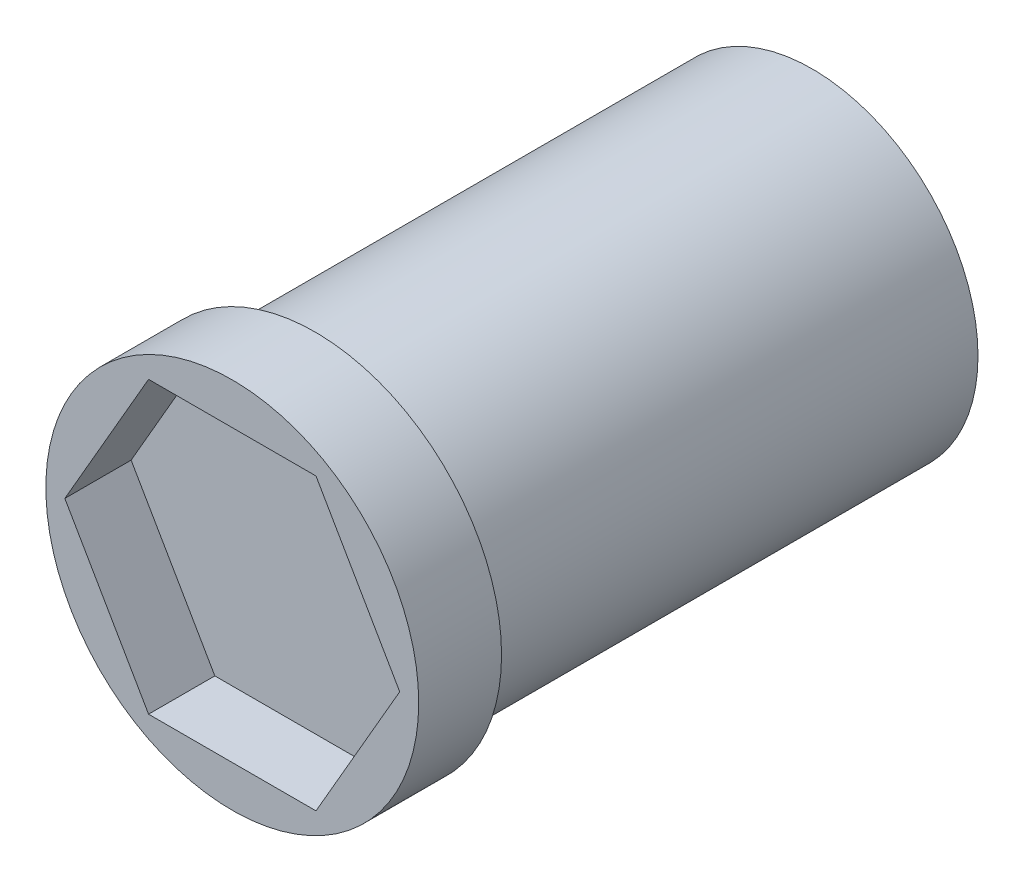
ISO-10303-21;
HEADER;
FILE_DESCRIPTION(('STEP AP214'),'2;1');
FILE_NAME('part.step','',(''),(''),'','','');
FILE_SCHEMA(('AUTOMOTIVE_DESIGN { 1 0 10303 214 1 1 1 1 }'));
ENDSEC;
DATA;
#1=APPLICATION_CONTEXT('core data for automotive mechanical design processes');
#2=APPLICATION_PROTOCOL_DEFINITION('international standard','automotive_design',2000,#1);
#3=PRODUCT_CONTEXT('',#1,'mechanical');
#4=PRODUCT('Part','Part','',(#3));
#5=PRODUCT_RELATED_PRODUCT_CATEGORY('part','',(#4));
#6=PRODUCT_DEFINITION_FORMATION('','',#4);
#7=PRODUCT_DEFINITION_CONTEXT('part definition',#1,'design');
#8=PRODUCT_DEFINITION('design','',#6,#7);
#9=PRODUCT_DEFINITION_SHAPE('','',#8);
#10=(LENGTH_UNIT() NAMED_UNIT(*) SI_UNIT(.MILLI.,.METRE.));
#11=(NAMED_UNIT(*) PLANE_ANGLE_UNIT() SI_UNIT($,.RADIAN.));
#12=(NAMED_UNIT(*) SI_UNIT($,.STERADIAN.) SOLID_ANGLE_UNIT());
#13=UNCERTAINTY_MEASURE_WITH_UNIT(LENGTH_MEASURE(1.E-05),#10,'distance_accuracy_value','');
#14=(GEOMETRIC_REPRESENTATION_CONTEXT(3) GLOBAL_UNCERTAINTY_ASSIGNED_CONTEXT((#13)) GLOBAL_UNIT_ASSIGNED_CONTEXT((#10,
#11,#12)) REPRESENTATION_CONTEXT('',''));
#15=CARTESIAN_POINT('',(0.,0.,0.));
#16=DIRECTION('',(0.,0.,1.));
#17=DIRECTION('',(1.,0.,0.));
#18=AXIS2_PLACEMENT_3D('',#15,#16,#17);
#19=CARTESIAN_POINT('',(0.,0.,60.));
#20=DIRECTION('',(0.,0.,-1.));
#21=DIRECTION('',(-1.,0.,0.));
#22=AXIS2_PLACEMENT_3D('',#19,#20,#21);
#23=CYLINDRICAL_SURFACE('',#22,20.);
#24=CARTESIAN_POINT('',(0.,0.,60.));
#25=DIRECTION('',(0.,0.,1.));
#26=DIRECTION('',(1.,0.,0.));
#27=AXIS2_PLACEMENT_3D('',#24,#25,#26);
#28=CIRCLE('',#27,20.);
#29=CARTESIAN_POINT('',(20.,0.,60.));
#30=VERTEX_POINT('',#29);
#31=EDGE_CURVE('E11',#30,#30,#28,.T.);
#32=ORIENTED_EDGE('',*,*,#31,.F.);
#33=EDGE_LOOP('',(#32));
#34=FACE_BOUND('',#33,.T.);
#35=CARTESIAN_POINT('',(0.,0.,0.));
#36=DIRECTION('',(0.,0.,1.));
#37=DIRECTION('',(1.,0.,0.));
#38=AXIS2_PLACEMENT_3D('',#35,#36,#37);
#39=CIRCLE('',#38,20.);
#40=CARTESIAN_POINT('',(20.,0.,0.));
#41=VERTEX_POINT('',#40);
#42=EDGE_CURVE('E46',#41,#41,#39,.T.);
#43=ORIENTED_EDGE('',*,*,#42,.T.);
#44=EDGE_LOOP('',(#43));
#45=FACE_BOUND('',#44,.T.);
#46=ADVANCED_FACE('F43',(#34,#45),#23,.T.);
#47=CARTESIAN_POINT('',(0.,0.,0.));
#48=DIRECTION('',(0.,0.,1.));
#49=DIRECTION('',(1.,0.,0.));
#50=AXIS2_PLACEMENT_3D('',#47,#48,#49);
#51=PLANE('',#50);
#52=ORIENTED_EDGE('',*,*,#42,.F.);
#53=EDGE_LOOP('',(#52));
#54=FACE_BOUND('',#53,.T.);
#55=ADVANCED_FACE('F193',(#54),#51,.F.);
#56=CARTESIAN_POINT('',(0.,0.,70.));
#57=DIRECTION('',(0.,0.,-1.));
#58=DIRECTION('',(-1.,0.,0.));
#59=AXIS2_PLACEMENT_3D('',#56,#57,#58);
#60=CYLINDRICAL_SURFACE('',#59,22.5);
#61=CARTESIAN_POINT('',(0.,0.,70.));
#62=DIRECTION('',(0.,0.,1.));
#63=DIRECTION('',(1.,0.,0.));
#64=AXIS2_PLACEMENT_3D('',#61,#62,#63);
#65=CIRCLE('',#64,22.5);
#66=CARTESIAN_POINT('',(22.5,0.,70.));
#67=VERTEX_POINT('',#66);
#68=EDGE_CURVE('E167',#67,#67,#65,.T.);
#69=ORIENTED_EDGE('',*,*,#68,.F.);
#70=EDGE_LOOP('',(#69));
#71=FACE_BOUND('',#70,.T.);
#72=CARTESIAN_POINT('',(0.,0.,60.));
#73=DIRECTION('',(0.,0.,1.));
#74=DIRECTION('',(1.,0.,0.));
#75=AXIS2_PLACEMENT_3D('',#72,#73,#74);
#76=CIRCLE('',#75,22.5);
#77=CARTESIAN_POINT('',(22.5,0.,60.));
#78=VERTEX_POINT('',#77);
#79=EDGE_CURVE('E157',#78,#78,#76,.T.);
#80=ORIENTED_EDGE('',*,*,#79,.T.);
#81=EDGE_LOOP('',(#80));
#82=FACE_BOUND('',#81,.T.);
#83=ADVANCED_FACE('F175',(#71,#82),#60,.T.);
#84=CARTESIAN_POINT('',(0.,0.,70.));
#85=DIRECTION('',(0.,0.,1.));
#86=DIRECTION('',(1.,0.,0.));
#87=AXIS2_PLACEMENT_3D('',#84,#85,#86);
#88=PLANE('',#87);
#89=DIRECTION('',(-0.5,-0.866025403784439,0.));
#90=VECTOR('',#89,1.);
#91=CARTESIAN_POINT('',(-10.1036297108185,17.5,70.));
#92=LINE('',#91,#90);
#93=CARTESIAN_POINT('',(-10.1036297108185,17.5,70.));
#94=VERTEX_POINT('',#93);
#95=CARTESIAN_POINT('',(-20.2072594216369,0.,70.));
#96=VERTEX_POINT('',#95);
#97=EDGE_CURVE('E58',#94,#96,#92,.T.);
#98=ORIENTED_EDGE('',*,*,#97,.F.);
#99=DIRECTION('',(-1.,0.,0.));
#100=VECTOR('',#99,1.);
#101=CARTESIAN_POINT('',(10.1036297108184,17.5,70.));
#102=LINE('',#101,#100);
#103=CARTESIAN_POINT('',(10.1036297108184,17.5,70.));
#104=VERTEX_POINT('',#103);
#105=EDGE_CURVE('E151',#104,#94,#102,.T.);
#106=ORIENTED_EDGE('',*,*,#105,.F.);
#107=DIRECTION('',(-0.5,0.866025403784439,0.));
#108=VECTOR('',#107,1.);
#109=CARTESIAN_POINT('',(20.2072594216369,0.,70.));
#110=LINE('',#109,#108);
#111=CARTESIAN_POINT('',(20.2072594216369,0.,70.));
#112=VERTEX_POINT('',#111);
#113=EDGE_CURVE('E148',#112,#104,#110,.T.);
#114=ORIENTED_EDGE('',*,*,#113,.F.);
#115=DIRECTION('',(0.5,0.866025403784439,0.));
#116=VECTOR('',#115,1.);
#117=CARTESIAN_POINT('',(10.1036297108185,-17.5,70.));
#118=LINE('',#117,#116);
#119=CARTESIAN_POINT('',(10.1036297108185,-17.5,70.));
#120=VERTEX_POINT('',#119);
#121=EDGE_CURVE('E106',#120,#112,#118,.T.);
#122=ORIENTED_EDGE('',*,*,#121,.F.);
#123=DIRECTION('',(1.,0.,0.));
#124=VECTOR('',#123,1.);
#125=CARTESIAN_POINT('',(-10.1036297108184,-17.5,70.));
#126=LINE('',#125,#124);
#127=CARTESIAN_POINT('',(-10.1036297108184,-17.5,70.));
#128=VERTEX_POINT('',#127);
#129=EDGE_CURVE('E142',#128,#120,#126,.T.);
#130=ORIENTED_EDGE('',*,*,#129,.F.);
#131=DIRECTION('',(0.5,-0.866025403784439,0.));
#132=VECTOR('',#131,1.);
#133=CARTESIAN_POINT('',(-20.2072594216369,0.,70.));
#134=LINE('',#133,#132);
#135=EDGE_CURVE('E138',#96,#128,#134,.T.);
#136=ORIENTED_EDGE('',*,*,#135,.F.);
#137=EDGE_LOOP('',(#98,#106,#114,#122,#130,#136));
#138=FACE_BOUND('',#137,.T.);
#139=ORIENTED_EDGE('',*,*,#68,.T.);
#140=EDGE_LOOP('',(#139));
#141=FACE_BOUND('',#140,.T.);
#142=ADVANCED_FACE('F180',(#138,#141),#88,.T.);
#143=CARTESIAN_POINT('',(0.,0.,60.));
#144=DIRECTION('',(0.,0.,1.));
#145=DIRECTION('',(1.,0.,0.));
#146=AXIS2_PLACEMENT_3D('',#143,#144,#145);
#147=PLANE('',#146);
#148=ORIENTED_EDGE('',*,*,#31,.T.);
#149=EDGE_LOOP('',(#148));
#150=FACE_BOUND('',#149,.T.);
#151=ORIENTED_EDGE('',*,*,#79,.F.);
#152=EDGE_LOOP('',(#151));
#153=FACE_BOUND('',#152,.T.);
#154=ADVANCED_FACE('F177',(#150,#153),#147,.F.);
#155=CARTESIAN_POINT('',(-10.1036297108185,17.5,62.));
#156=DIRECTION('',(-0.866025403784439,0.5,0.));
#157=DIRECTION('',(-0.5,-0.866025403784439,0.));
#158=AXIS2_PLACEMENT_3D('',#155,#156,#157);
#159=PLANE('',#158);
#160=ORIENTED_EDGE('',*,*,#97,.T.);
#161=DIRECTION('',(0.,0.,1.));
#162=VECTOR('',#161,1.);
#163=CARTESIAN_POINT('',(-20.2072594216369,0.,62.));
#164=LINE('',#163,#162);
#165=CARTESIAN_POINT('',(-20.2072594216369,0.,62.));
#166=VERTEX_POINT('',#165);
#167=EDGE_CURVE('E88',#166,#96,#164,.T.);
#168=ORIENTED_EDGE('',*,*,#167,.F.);
#169=DIRECTION('',(-0.5,-0.866025403784439,0.));
#170=VECTOR('',#169,1.);
#171=CARTESIAN_POINT('',(-10.1036297108185,17.5,62.));
#172=LINE('',#171,#170);
#173=CARTESIAN_POINT('',(-10.1036297108185,17.5,62.));
#174=VERTEX_POINT('',#173);
#175=EDGE_CURVE('E154',#174,#166,#172,.T.);
#176=ORIENTED_EDGE('',*,*,#175,.F.);
#177=DIRECTION('',(0.,0.,1.));
#178=VECTOR('',#177,1.);
#179=CARTESIAN_POINT('',(-10.1036297108185,17.5,62.));
#180=LINE('',#179,#178);
#181=EDGE_CURVE('E66',#174,#94,#180,.T.);
#182=ORIENTED_EDGE('',*,*,#181,.T.);
#183=EDGE_LOOP('',(#160,#168,#176,#182));
#184=FACE_BOUND('',#183,.T.);
#185=ADVANCED_FACE('F179',(#184),#159,.F.);
#186=CARTESIAN_POINT('',(10.1036297108184,17.5,62.));
#187=DIRECTION('',(0.,1.,0.));
#188=DIRECTION('',(-1.,0.,0.));
#189=AXIS2_PLACEMENT_3D('',#186,#187,#188);
#190=PLANE('',#189);
#191=ORIENTED_EDGE('',*,*,#105,.T.);
#192=ORIENTED_EDGE('',*,*,#181,.F.);
#193=DIRECTION('',(-1.,0.,0.));
#194=VECTOR('',#193,1.);
#195=CARTESIAN_POINT('',(10.1036297108184,17.5,62.));
#196=LINE('',#195,#194);
#197=CARTESIAN_POINT('',(10.1036297108184,17.5,62.));
#198=VERTEX_POINT('',#197);
#199=EDGE_CURVE('E120',#198,#174,#196,.T.);
#200=ORIENTED_EDGE('',*,*,#199,.F.);
#201=DIRECTION('',(0.,0.,1.));
#202=VECTOR('',#201,1.);
#203=CARTESIAN_POINT('',(10.1036297108184,17.5,62.));
#204=LINE('',#203,#202);
#205=EDGE_CURVE('E111',#198,#104,#204,.T.);
#206=ORIENTED_EDGE('',*,*,#205,.T.);
#207=EDGE_LOOP('',(#191,#192,#200,#206));
#208=FACE_BOUND('',#207,.T.);
#209=ADVANCED_FACE('F187',(#208),#190,.F.);
#210=CARTESIAN_POINT('',(20.2072594216369,0.,62.));
#211=DIRECTION('',(0.866025403784439,0.5,0.));
#212=DIRECTION('',(-0.5,0.866025403784439,0.));
#213=AXIS2_PLACEMENT_3D('',#210,#211,#212);
#214=PLANE('',#213);
#215=ORIENTED_EDGE('',*,*,#113,.T.);
#216=ORIENTED_EDGE('',*,*,#205,.F.);
#217=DIRECTION('',(-0.5,0.866025403784439,0.));
#218=VECTOR('',#217,1.);
#219=CARTESIAN_POINT('',(20.2072594216369,0.,62.));
#220=LINE('',#219,#218);
#221=CARTESIAN_POINT('',(20.2072594216369,0.,62.));
#222=VERTEX_POINT('',#221);
#223=EDGE_CURVE('E115',#222,#198,#220,.T.);
#224=ORIENTED_EDGE('',*,*,#223,.F.);
#225=DIRECTION('',(0.,0.,1.));
#226=VECTOR('',#225,1.);
#227=CARTESIAN_POINT('',(20.2072594216369,0.,62.));
#228=LINE('',#227,#226);
#229=EDGE_CURVE('E99',#222,#112,#228,.T.);
#230=ORIENTED_EDGE('',*,*,#229,.T.);
#231=EDGE_LOOP('',(#215,#216,#224,#230));
#232=FACE_BOUND('',#231,.T.);
#233=ADVANCED_FACE('F116',(#232),#214,.F.);
#234=CARTESIAN_POINT('',(10.1036297108185,-17.5,62.));
#235=DIRECTION('',(0.866025403784439,-0.5,0.));
#236=DIRECTION('',(0.5,0.866025403784439,0.));
#237=AXIS2_PLACEMENT_3D('',#234,#235,#236);
#238=PLANE('',#237);
#239=ORIENTED_EDGE('',*,*,#121,.T.);
#240=ORIENTED_EDGE('',*,*,#229,.F.);
#241=DIRECTION('',(0.5,0.866025403784439,0.));
#242=VECTOR('',#241,1.);
#243=CARTESIAN_POINT('',(10.1036297108185,-17.5,62.));
#244=LINE('',#243,#242);
#245=CARTESIAN_POINT('',(10.1036297108185,-17.5,62.));
#246=VERTEX_POINT('',#245);
#247=EDGE_CURVE('E103',#246,#222,#244,.T.);
#248=ORIENTED_EDGE('',*,*,#247,.F.);
#249=DIRECTION('',(0.,0.,1.));
#250=VECTOR('',#249,1.);
#251=CARTESIAN_POINT('',(10.1036297108185,-17.5,62.));
#252=LINE('',#251,#250);
#253=EDGE_CURVE('E112',#246,#120,#252,.T.);
#254=ORIENTED_EDGE('',*,*,#253,.T.);
#255=EDGE_LOOP('',(#239,#240,#248,#254));
#256=FACE_BOUND('',#255,.T.);
#257=ADVANCED_FACE('F101',(#256),#238,.F.);
#258=CARTESIAN_POINT('',(-10.1036297108184,-17.5,62.));
#259=DIRECTION('',(0.,-1.,0.));
#260=DIRECTION('',(0.,0.,-1.));
#261=AXIS2_PLACEMENT_3D('',#258,#259,#260);
#262=PLANE('',#261);
#263=ORIENTED_EDGE('',*,*,#129,.T.);
#264=ORIENTED_EDGE('',*,*,#253,.F.);
#265=DIRECTION('',(1.,0.,0.));
#266=VECTOR('',#265,1.);
#267=CARTESIAN_POINT('',(-10.1036297108184,-17.5,62.));
#268=LINE('',#267,#266);
#269=CARTESIAN_POINT('',(-10.1036297108184,-17.5,62.));
#270=VERTEX_POINT('',#269);
#271=EDGE_CURVE('E126',#270,#246,#268,.T.);
#272=ORIENTED_EDGE('',*,*,#271,.F.);
#273=DIRECTION('',(0.,0.,1.));
#274=VECTOR('',#273,1.);
#275=CARTESIAN_POINT('',(-10.1036297108184,-17.5,62.));
#276=LINE('',#275,#274);
#277=EDGE_CURVE('E162',#270,#128,#276,.T.);
#278=ORIENTED_EDGE('',*,*,#277,.T.);
#279=EDGE_LOOP('',(#263,#264,#272,#278));
#280=FACE_BOUND('',#279,.T.);
#281=ADVANCED_FACE('F253',(#280),#262,.F.);
#282=CARTESIAN_POINT('',(-20.2072594216369,0.,62.));
#283=DIRECTION('',(-0.866025403784439,-0.5,0.));
#284=DIRECTION('',(0.5,-0.866025403784439,0.));
#285=AXIS2_PLACEMENT_3D('',#282,#283,#284);
#286=PLANE('',#285);
#287=ORIENTED_EDGE('',*,*,#135,.T.);
#288=ORIENTED_EDGE('',*,*,#277,.F.);
#289=DIRECTION('',(0.5,-0.866025403784439,0.));
#290=VECTOR('',#289,1.);
#291=CARTESIAN_POINT('',(-20.2072594216369,0.,62.));
#292=LINE('',#291,#290);
#293=EDGE_CURVE('E130',#166,#270,#292,.T.);
#294=ORIENTED_EDGE('',*,*,#293,.F.);
#295=ORIENTED_EDGE('',*,*,#167,.T.);
#296=EDGE_LOOP('',(#287,#288,#294,#295));
#297=FACE_BOUND('',#296,.T.);
#298=ADVANCED_FACE('F263',(#297),#286,.F.);
#299=CARTESIAN_POINT('',(0.,0.,62.));
#300=DIRECTION('',(0.,0.,1.));
#301=DIRECTION('',(1.,0.,0.));
#302=AXIS2_PLACEMENT_3D('',#299,#300,#301);
#303=PLANE('',#302);
#304=ORIENTED_EDGE('',*,*,#175,.T.);
#305=ORIENTED_EDGE('',*,*,#293,.T.);
#306=ORIENTED_EDGE('',*,*,#271,.T.);
#307=ORIENTED_EDGE('',*,*,#247,.T.);
#308=ORIENTED_EDGE('',*,*,#223,.T.);
#309=ORIENTED_EDGE('',*,*,#199,.T.);
#310=EDGE_LOOP('',(#304,#305,#306,#307,#308,#309));
#311=FACE_BOUND('',#310,.T.);
#312=ADVANCED_FACE('F123',(#311),#303,.T.);
#313=CLOSED_SHELL('',(#46,#55,#83,#142,#154,#185,#209,#233,#257,#281,#298,#312));
#314=MANIFOLD_SOLID_BREP('B2',#313);
#315=ADVANCED_BREP_SHAPE_REPRESENTATION('',(#18,#314),#14);
#316=SHAPE_DEFINITION_REPRESENTATION(#9,#315);
ENDSEC;
END-ISO-10303-21;
